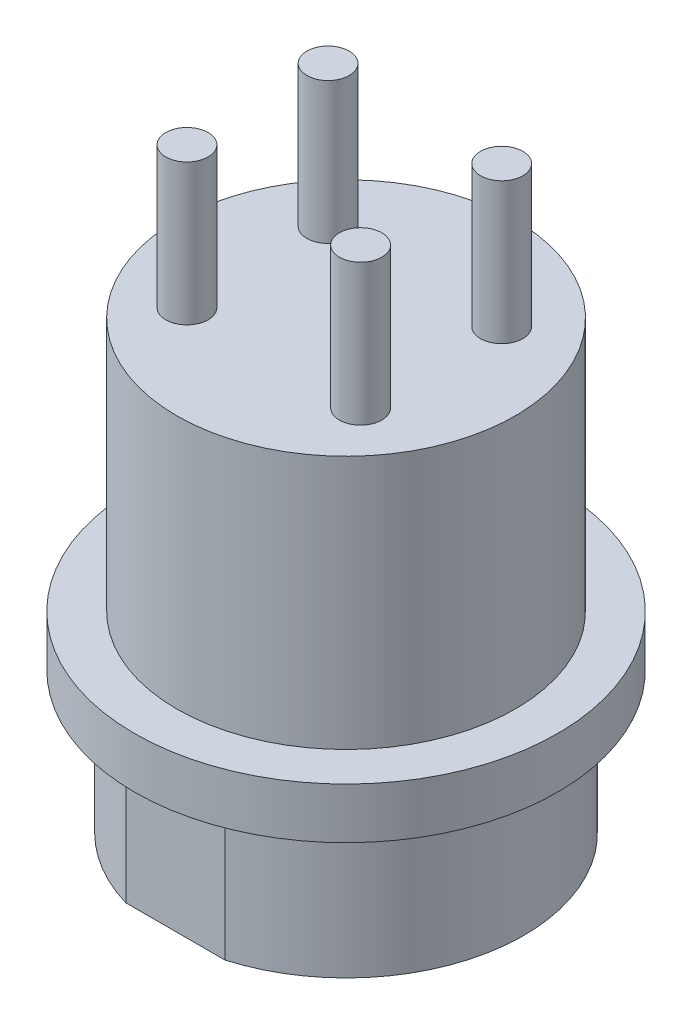
ISO-10303-21;
HEADER;
FILE_DESCRIPTION(('STEP AP214'),'2;1');
FILE_NAME('part.step','',(''),(''),'','','');
FILE_SCHEMA(('AUTOMOTIVE_DESIGN { 1 0 10303 214 1 1 1 1 }'));
ENDSEC;
DATA;
#1=APPLICATION_CONTEXT('core data for automotive mechanical design processes');
#2=APPLICATION_PROTOCOL_DEFINITION('international standard','automotive_design',2000,#1);
#3=PRODUCT_CONTEXT('',#1,'mechanical');
#4=PRODUCT('Part','Part','',(#3));
#5=PRODUCT_RELATED_PRODUCT_CATEGORY('part','',(#4));
#6=PRODUCT_DEFINITION_FORMATION('','',#4);
#7=PRODUCT_DEFINITION_CONTEXT('part definition',#1,'design');
#8=PRODUCT_DEFINITION('design','',#6,#7);
#9=PRODUCT_DEFINITION_SHAPE('','',#8);
#10=(LENGTH_UNIT() NAMED_UNIT(*) SI_UNIT(.MILLI.,.METRE.));
#11=(NAMED_UNIT(*) PLANE_ANGLE_UNIT() SI_UNIT($,.RADIAN.));
#12=(NAMED_UNIT(*) SI_UNIT($,.STERADIAN.) SOLID_ANGLE_UNIT());
#13=UNCERTAINTY_MEASURE_WITH_UNIT(LENGTH_MEASURE(1.E-05),#10,'distance_accuracy_value','');
#14=(GEOMETRIC_REPRESENTATION_CONTEXT(3) GLOBAL_UNCERTAINTY_ASSIGNED_CONTEXT((#13)) GLOBAL_UNIT_ASSIGNED_CONTEXT((#10,
#11,#12)) REPRESENTATION_CONTEXT('',''));
#15=CARTESIAN_POINT('',(0.,0.,0.));
#16=DIRECTION('',(0.,0.,1.));
#17=DIRECTION('',(1.,0.,0.));
#18=AXIS2_PLACEMENT_3D('',#15,#16,#17);
#19=CARTESIAN_POINT('',(0.,5.,0.));
#20=DIRECTION('',(0.,-1.,0.));
#21=DIRECTION('',(0.,0.,-1.));
#22=AXIS2_PLACEMENT_3D('',#19,#20,#21);
#23=CYLINDRICAL_SURFACE('',#22,6.3);
#24=CARTESIAN_POINT('',(0.,5.,0.));
#25=DIRECTION('',(0.,1.,0.));
#26=DIRECTION('',(0.,0.,1.));
#27=AXIS2_PLACEMENT_3D('',#24,#25,#26);
#28=CIRCLE('',#27,6.3);
#29=CARTESIAN_POINT('',(1.75712833908055,5.,6.05));
#30=VERTEX_POINT('',#29);
#31=CARTESIAN_POINT('',(2.55169780596398,5.,-5.76010749092746));
#32=VERTEX_POINT('',#31);
#33=EDGE_CURVE('E100',#30,#32,#28,.T.);
#34=ORIENTED_EDGE('',*,*,#33,.F.);
#35=DIRECTION('',(0.,-1.,0.));
#36=VECTOR('',#35,1.);
#37=CARTESIAN_POINT('',(1.75712833908055,5.,6.05));
#38=LINE('',#37,#36);
#39=CARTESIAN_POINT('',(1.75712833908055,0.,6.05));
#40=VERTEX_POINT('',#39);
#41=EDGE_CURVE('E235',#30,#40,#38,.T.);
#42=ORIENTED_EDGE('',*,*,#41,.T.);
#43=CARTESIAN_POINT('',(0.,0.,0.));
#44=DIRECTION('',(0.,1.,0.));
#45=DIRECTION('',(0.,0.,1.));
#46=AXIS2_PLACEMENT_3D('',#43,#44,#45);
#47=CIRCLE('',#46,6.3);
#48=CARTESIAN_POINT('',(2.55169780596398,0.,-5.76010749092746));
#49=VERTEX_POINT('',#48);
#50=EDGE_CURVE('E102',#40,#49,#47,.T.);
#51=ORIENTED_EDGE('',*,*,#50,.T.);
#52=DIRECTION('',(0.,-1.,0.));
#53=VECTOR('',#52,1.);
#54=CARTESIAN_POINT('',(2.55169780596398,5.,-5.76010749092746));
#55=LINE('',#54,#53);
#56=EDGE_CURVE('E57',#49,#32,#55,.F.);
#57=ORIENTED_EDGE('',*,*,#56,.T.);
#58=EDGE_LOOP('',(#34,#42,#51,#57));
#59=FACE_BOUND('',#58,.T.);
#60=ADVANCED_FACE('F34',(#59),#23,.T.);
#61=CARTESIAN_POINT('',(0.,10.,0.));
#62=DIRECTION('',(0.,-1.,0.));
#63=DIRECTION('',(0.,0.,-1.));
#64=AXIS2_PLACEMENT_3D('',#61,#62,#63);
#65=CYLINDRICAL_SURFACE('',#64,4.5);
#66=DIRECTION('',(0.,1.,0.));
#67=VECTOR('',#66,1.);
#68=CARTESIAN_POINT('',(-0.499227798766984,5.,4.47222222222222));
#69=LINE('',#68,#67);
#70=CARTESIAN_POINT('',(-0.499227798766984,0.,4.47222222222222));
#71=VERTEX_POINT('',#70);
#72=CARTESIAN_POINT('',(-0.499227798766983,10.,4.47222222222222));
#73=VERTEX_POINT('',#72);
#74=EDGE_CURVE('E193',#71,#73,#69,.T.);
#75=ORIENTED_EDGE('',*,*,#74,.F.);
#76=CARTESIAN_POINT('',(0.,0.,0.));
#77=DIRECTION('',(0.,-1.,0.));
#78=DIRECTION('',(0.,0.,-1.));
#79=AXIS2_PLACEMENT_3D('',#76,#77,#78);
#80=CIRCLE('',#79,4.5);
#81=CARTESIAN_POINT('',(0.499227798766984,0.,4.47222222222222));
#82=VERTEX_POINT('',#81);
#83=EDGE_CURVE('E190',#71,#82,#80,.T.);
#84=ORIENTED_EDGE('',*,*,#83,.T.);
#85=DIRECTION('',(0.,1.,0.));
#86=VECTOR('',#85,1.);
#87=CARTESIAN_POINT('',(0.499227798766984,5.,4.47222222222222));
#88=LINE('',#87,#86);
#89=CARTESIAN_POINT('',(0.499227798766984,10.,4.47222222222222));
#90=VERTEX_POINT('',#89);
#91=EDGE_CURVE('E197',#90,#82,#88,.F.);
#92=ORIENTED_EDGE('',*,*,#91,.F.);
#93=CARTESIAN_POINT('',(0.,10.,0.));
#94=DIRECTION('',(0.,-1.,0.));
#95=DIRECTION('',(0.,0.,-1.));
#96=AXIS2_PLACEMENT_3D('',#93,#94,#95);
#97=CIRCLE('',#96,4.5);
#98=EDGE_CURVE('E189',#73,#90,#97,.T.);
#99=ORIENTED_EDGE('',*,*,#98,.F.);
#100=EDGE_LOOP('',(#75,#84,#92,#99));
#101=FACE_BOUND('',#100,.T.);
#102=ADVANCED_FACE('F159',(#101),#65,.F.);
#103=CARTESIAN_POINT('',(-2.55169780596398,0.,-5.76010749092746));
#104=VERTEX_POINT('',#103);
#105=CARTESIAN_POINT('',(-1.75712833908055,0.,6.05));
#106=VERTEX_POINT('',#105);
#107=EDGE_CURVE('E119',#104,#106,#47,.T.);
#108=ORIENTED_EDGE('',*,*,#107,.T.);
#109=DIRECTION('',(0.,-1.,0.));
#110=VECTOR('',#109,1.);
#111=CARTESIAN_POINT('',(-1.75712833908055,5.,6.05));
#112=LINE('',#111,#110);
#113=CARTESIAN_POINT('',(-1.75712833908055,5.,6.05));
#114=VERTEX_POINT('',#113);
#115=EDGE_CURVE('E49',#106,#114,#112,.F.);
#116=ORIENTED_EDGE('',*,*,#115,.T.);
#117=CARTESIAN_POINT('',(-2.55169780596398,5.,-5.76010749092746));
#118=VERTEX_POINT('',#117);
#119=EDGE_CURVE('E109',#118,#114,#28,.T.);
#120=ORIENTED_EDGE('',*,*,#119,.F.);
#121=DIRECTION('',(0.,-1.,0.));
#122=VECTOR('',#121,1.);
#123=CARTESIAN_POINT('',(-2.55169780596398,5.,-5.76010749092746));
#124=LINE('',#123,#122);
#125=EDGE_CURVE('E88',#118,#104,#124,.T.);
#126=ORIENTED_EDGE('',*,*,#125,.T.);
#127=EDGE_LOOP('',(#108,#116,#120,#126));
#128=FACE_BOUND('',#127,.T.);
#129=ADVANCED_FACE('F161',(#128),#23,.T.);
#130=CARTESIAN_POINT('',(0.,0.,0.));
#131=DIRECTION('',(0.,1.,0.));
#132=DIRECTION('',(0.,0.,1.));
#133=AXIS2_PLACEMENT_3D('',#130,#131,#132);
#134=PLANE('',#133);
#135=ORIENTED_EDGE('',*,*,#83,.F.);
#136=CARTESIAN_POINT('',(0.,0.,4.5));
#137=DIRECTION('',(0.,1.,0.));
#138=DIRECTION('',(0.,0.,1.));
#139=AXIS2_PLACEMENT_3D('',#136,#137,#138);
#140=CIRCLE('',#139,0.5);
#141=EDGE_CURVE('E199',#82,#71,#140,.T.);
#142=ORIENTED_EDGE('',*,*,#141,.F.);
#143=EDGE_LOOP('',(#135,#142));
#144=FACE_BOUND('',#143,.T.);
#145=ORIENTED_EDGE('',*,*,#50,.F.);
#146=DIRECTION('',(1.,0.,0.));
#147=VECTOR('',#146,1.);
#148=CARTESIAN_POINT('',(-5.00000000000001,0.,6.05));
#149=LINE('',#148,#147);
#150=EDGE_CURVE('E93',#106,#40,#149,.T.);
#151=ORIENTED_EDGE('',*,*,#150,.F.);
#152=ORIENTED_EDGE('',*,*,#107,.F.);
#153=DIRECTION('',(-1.,0.,0.));
#154=VECTOR('',#153,1.);
#155=CARTESIAN_POINT('',(-5.,0.,-5.76010749092746));
#156=LINE('',#155,#154);
#157=EDGE_CURVE('E94',#49,#104,#156,.T.);
#158=ORIENTED_EDGE('',*,*,#157,.F.);
#159=EDGE_LOOP('',(#145,#151,#152,#158));
#160=FACE_BOUND('',#159,.T.);
#161=ADVANCED_FACE('F170',(#144,#160),#134,.F.);
#162=CARTESIAN_POINT('',(0.,6.8,0.));
#163=DIRECTION('',(0.,-1.,0.));
#164=DIRECTION('',(0.,0.,-1.));
#165=AXIS2_PLACEMENT_3D('',#162,#163,#164);
#166=CYLINDRICAL_SURFACE('',#165,7.5);
#167=CARTESIAN_POINT('',(0.,6.8,0.));
#168=DIRECTION('',(0.,1.,0.));
#169=DIRECTION('',(0.,0.,1.));
#170=AXIS2_PLACEMENT_3D('',#167,#168,#169);
#171=CIRCLE('',#170,7.5);
#172=CARTESIAN_POINT('',(0.,6.8,7.5));
#173=VERTEX_POINT('',#172);
#174=EDGE_CURVE('E180',#173,#173,#171,.T.);
#175=ORIENTED_EDGE('',*,*,#174,.F.);
#176=EDGE_LOOP('',(#175));
#177=FACE_BOUND('',#176,.T.);
#178=CARTESIAN_POINT('',(0.,5.,0.));
#179=DIRECTION('',(0.,1.,0.));
#180=DIRECTION('',(0.,0.,1.));
#181=AXIS2_PLACEMENT_3D('',#178,#179,#180);
#182=CIRCLE('',#181,7.5);
#183=CARTESIAN_POINT('',(0.,5.,7.5));
#184=VERTEX_POINT('',#183);
#185=EDGE_CURVE('E116',#184,#184,#182,.T.);
#186=ORIENTED_EDGE('',*,*,#185,.T.);
#187=EDGE_LOOP('',(#186));
#188=FACE_BOUND('',#187,.T.);
#189=ADVANCED_FACE('F175',(#177,#188),#166,.T.);
#190=CARTESIAN_POINT('',(0.,6.8,0.));
#191=DIRECTION('',(0.,1.,0.));
#192=DIRECTION('',(0.,0.,1.));
#193=AXIS2_PLACEMENT_3D('',#190,#191,#192);
#194=PLANE('',#193);
#195=CARTESIAN_POINT('',(0.,6.8,0.));
#196=DIRECTION('',(0.,1.,0.));
#197=DIRECTION('',(0.,0.,1.));
#198=AXIS2_PLACEMENT_3D('',#195,#196,#197);
#199=CIRCLE('',#198,6.);
#200=CARTESIAN_POINT('',(0.,6.8,6.));
#201=VERTEX_POINT('',#200);
#202=EDGE_CURVE('E108',#201,#201,#199,.T.);
#203=ORIENTED_EDGE('',*,*,#202,.F.);
#204=EDGE_LOOP('',(#203));
#205=FACE_BOUND('',#204,.T.);
#206=ORIENTED_EDGE('',*,*,#174,.T.);
#207=EDGE_LOOP('',(#206));
#208=FACE_BOUND('',#207,.T.);
#209=ADVANCED_FACE('F325',(#205,#208),#194,.T.);
#210=CARTESIAN_POINT('',(0.,5.,0.));
#211=DIRECTION('',(0.,1.,0.));
#212=DIRECTION('',(0.,0.,1.));
#213=AXIS2_PLACEMENT_3D('',#210,#211,#212);
#214=PLANE('',#213);
#215=ORIENTED_EDGE('',*,*,#119,.T.);
#216=DIRECTION('',(1.,0.,0.));
#217=VECTOR('',#216,1.);
#218=CARTESIAN_POINT('',(-5.00000000000001,5.,6.05));
#219=LINE('',#218,#217);
#220=EDGE_CURVE('E103',#114,#30,#219,.T.);
#221=ORIENTED_EDGE('',*,*,#220,.T.);
#222=ORIENTED_EDGE('',*,*,#33,.T.);
#223=DIRECTION('',(-1.,0.,0.));
#224=VECTOR('',#223,1.);
#225=CARTESIAN_POINT('',(-5.,5.,-5.76010749092746));
#226=LINE('',#225,#224);
#227=EDGE_CURVE('E85',#32,#118,#226,.T.);
#228=ORIENTED_EDGE('',*,*,#227,.T.);
#229=EDGE_LOOP('',(#215,#221,#222,#228));
#230=FACE_BOUND('',#229,.T.);
#231=ORIENTED_EDGE('',*,*,#185,.F.);
#232=EDGE_LOOP('',(#231));
#233=FACE_BOUND('',#232,.T.);
#234=ADVANCED_FACE('F106',(#230,#233),#214,.F.);
#235=CARTESIAN_POINT('',(0.,15.8,0.));
#236=DIRECTION('',(0.,-1.,0.));
#237=DIRECTION('',(0.,0.,-1.));
#238=AXIS2_PLACEMENT_3D('',#235,#236,#237);
#239=CYLINDRICAL_SURFACE('',#238,6.);
#240=CARTESIAN_POINT('',(0.,15.8,0.));
#241=DIRECTION('',(0.,1.,0.));
#242=DIRECTION('',(0.,0.,1.));
#243=AXIS2_PLACEMENT_3D('',#240,#241,#242);
#244=CIRCLE('',#243,6.);
#245=CARTESIAN_POINT('',(0.,15.8,6.));
#246=VERTEX_POINT('',#245);
#247=EDGE_CURVE('E185',#246,#246,#244,.T.);
#248=ORIENTED_EDGE('',*,*,#247,.F.);
#249=EDGE_LOOP('',(#248));
#250=FACE_BOUND('',#249,.T.);
#251=ORIENTED_EDGE('',*,*,#202,.T.);
#252=EDGE_LOOP('',(#251));
#253=FACE_BOUND('',#252,.T.);
#254=ADVANCED_FACE('F320',(#250,#253),#239,.T.);
#255=CARTESIAN_POINT('',(0.,15.8,0.));
#256=DIRECTION('',(0.,1.,0.));
#257=DIRECTION('',(0.,0.,1.));
#258=AXIS2_PLACEMENT_3D('',#255,#256,#257);
#259=PLANE('',#258);
#260=CARTESIAN_POINT('',(3.01543648249437,15.8,-2.5));
#261=DIRECTION('',(0.,1.,0.));
#262=DIRECTION('',(0.,0.,1.));
#263=AXIS2_PLACEMENT_3D('',#260,#261,#262);
#264=CIRCLE('',#263,0.75);
#265=CARTESIAN_POINT('',(3.01543648249437,15.8,-1.75));
#266=VERTEX_POINT('',#265);
#267=EDGE_CURVE('E232',#266,#266,#264,.T.);
#268=ORIENTED_EDGE('',*,*,#267,.F.);
#269=EDGE_LOOP('',(#268));
#270=FACE_BOUND('',#269,.T.);
#271=CARTESIAN_POINT('',(3.01543648249437,15.8,2.5));
#272=DIRECTION('',(0.,1.,0.));
#273=DIRECTION('',(0.,0.,1.));
#274=AXIS2_PLACEMENT_3D('',#271,#272,#273);
#275=CIRCLE('',#274,0.75);
#276=CARTESIAN_POINT('',(3.01543648249437,15.8,3.25));
#277=VERTEX_POINT('',#276);
#278=EDGE_CURVE('E226',#277,#277,#275,.T.);
#279=ORIENTED_EDGE('',*,*,#278,.F.);
#280=EDGE_LOOP('',(#279));
#281=FACE_BOUND('',#280,.T.);
#282=CARTESIAN_POINT('',(-3.13801520129497,15.8,2.5));
#283=DIRECTION('',(0.,1.,0.));
#284=DIRECTION('',(0.,0.,1.));
#285=AXIS2_PLACEMENT_3D('',#282,#283,#284);
#286=CIRCLE('',#285,0.75);
#287=CARTESIAN_POINT('',(-3.13801520129497,15.8,3.25));
#288=VERTEX_POINT('',#287);
#289=EDGE_CURVE('E220',#288,#288,#286,.T.);
#290=ORIENTED_EDGE('',*,*,#289,.F.);
#291=EDGE_LOOP('',(#290));
#292=FACE_BOUND('',#291,.T.);
#293=CARTESIAN_POINT('',(-3.13801520129497,15.8,-2.5));
#294=DIRECTION('',(0.,1.,0.));
#295=DIRECTION('',(0.,0.,1.));
#296=AXIS2_PLACEMENT_3D('',#293,#294,#295);
#297=CIRCLE('',#296,0.75);
#298=CARTESIAN_POINT('',(-3.13801520129497,15.8,-1.75));
#299=VERTEX_POINT('',#298);
#300=EDGE_CURVE('E214',#299,#299,#297,.T.);
#301=ORIENTED_EDGE('',*,*,#300,.F.);
#302=EDGE_LOOP('',(#301));
#303=FACE_BOUND('',#302,.T.);
#304=ORIENTED_EDGE('',*,*,#247,.T.);
#305=EDGE_LOOP('',(#304));
#306=FACE_BOUND('',#305,.T.);
#307=ADVANCED_FACE('F315',(#270,#281,#292,#303,#306),#259,.T.);
#308=CARTESIAN_POINT('',(0.,10.,0.));
#309=DIRECTION('',(0.,-1.,0.));
#310=DIRECTION('',(0.,0.,-1.));
#311=AXIS2_PLACEMENT_3D('',#308,#309,#310);
#312=PLANE('',#311);
#313=CARTESIAN_POINT('',(-2.,10.,-2.));
#314=DIRECTION('',(0.,-1.,0.));
#315=DIRECTION('',(0.,0.,-1.));
#316=AXIS2_PLACEMENT_3D('',#313,#314,#315);
#317=CIRCLE('',#316,0.5);
#318=CARTESIAN_POINT('',(-2.,10.,-2.5));
#319=VERTEX_POINT('',#318);
#320=EDGE_CURVE('E210',#319,#319,#317,.T.);
#321=ORIENTED_EDGE('',*,*,#320,.F.);
#322=EDGE_LOOP('',(#321));
#323=FACE_BOUND('',#322,.T.);
#324=CARTESIAN_POINT('',(2.,10.,-2.));
#325=DIRECTION('',(0.,-1.,0.));
#326=DIRECTION('',(0.,0.,-1.));
#327=AXIS2_PLACEMENT_3D('',#324,#325,#326);
#328=CIRCLE('',#327,0.5);
#329=CARTESIAN_POINT('',(2.,10.,-2.5));
#330=VERTEX_POINT('',#329);
#331=EDGE_CURVE('E207',#330,#330,#328,.T.);
#332=ORIENTED_EDGE('',*,*,#331,.F.);
#333=EDGE_LOOP('',(#332));
#334=FACE_BOUND('',#333,.T.);
#335=CARTESIAN_POINT('',(2.,10.,2.));
#336=DIRECTION('',(0.,-1.,0.));
#337=DIRECTION('',(0.,0.,-1.));
#338=AXIS2_PLACEMENT_3D('',#335,#336,#337);
#339=CIRCLE('',#338,0.5);
#340=CARTESIAN_POINT('',(2.,10.,1.5));
#341=VERTEX_POINT('',#340);
#342=EDGE_CURVE('E204',#341,#341,#339,.T.);
#343=ORIENTED_EDGE('',*,*,#342,.F.);
#344=EDGE_LOOP('',(#343));
#345=FACE_BOUND('',#344,.T.);
#346=CARTESIAN_POINT('',(-2.,10.,2.));
#347=DIRECTION('',(0.,-1.,0.));
#348=DIRECTION('',(0.,0.,-1.));
#349=AXIS2_PLACEMENT_3D('',#346,#347,#348);
#350=CIRCLE('',#349,0.5);
#351=CARTESIAN_POINT('',(-2.,10.,1.5));
#352=VERTEX_POINT('',#351);
#353=EDGE_CURVE('E201',#352,#352,#350,.T.);
#354=ORIENTED_EDGE('',*,*,#353,.F.);
#355=EDGE_LOOP('',(#354));
#356=FACE_BOUND('',#355,.T.);
#357=ORIENTED_EDGE('',*,*,#98,.T.);
#358=CARTESIAN_POINT('',(0.,10.,4.5));
#359=DIRECTION('',(0.,-1.,0.));
#360=DIRECTION('',(0.,0.,-1.));
#361=AXIS2_PLACEMENT_3D('',#358,#359,#360);
#362=CIRCLE('',#361,0.5);
#363=EDGE_CURVE('E112',#90,#73,#362,.F.);
#364=ORIENTED_EDGE('',*,*,#363,.T.);
#365=EDGE_LOOP('',(#357,#364));
#366=FACE_BOUND('',#365,.T.);
#367=ADVANCED_FACE('F312',(#323,#334,#345,#356,#366),#312,.T.);
#368=CARTESIAN_POINT('',(0.,-1.1180339887499,4.5));
#369=DIRECTION('',(0.,1.,0.));
#370=DIRECTION('',(0.,0.,1.));
#371=AXIS2_PLACEMENT_3D('',#368,#369,#370);
#372=CYLINDRICAL_SURFACE('',#371,0.5);
#373=ORIENTED_EDGE('',*,*,#141,.T.);
#374=ORIENTED_EDGE('',*,*,#74,.T.);
#375=ORIENTED_EDGE('',*,*,#363,.F.);
#376=ORIENTED_EDGE('',*,*,#91,.T.);
#377=EDGE_LOOP('',(#373,#374,#375,#376));
#378=FACE_BOUND('',#377,.T.);
#379=ADVANCED_FACE('F308',(#378),#372,.T.);
#380=CARTESIAN_POINT('',(-2.,2.,2.));
#381=DIRECTION('',(0.,1.,0.));
#382=DIRECTION('',(0.,0.,1.));
#383=AXIS2_PLACEMENT_3D('',#380,#381,#382);
#384=CYLINDRICAL_SURFACE('',#383,0.5);
#385=CARTESIAN_POINT('',(-2.,2.2,2.));
#386=DIRECTION('',(0.,-1.,0.));
#387=DIRECTION('',(0.,0.,-1.));
#388=AXIS2_PLACEMENT_3D('',#385,#386,#387);
#389=CIRCLE('',#388,0.5);
#390=CARTESIAN_POINT('',(-2.,2.2,1.5));
#391=VERTEX_POINT('',#390);
#392=EDGE_CURVE('E11',#391,#391,#389,.F.);
#393=ORIENTED_EDGE('',*,*,#392,.T.);
#394=EDGE_LOOP('',(#393));
#395=FACE_BOUND('',#394,.T.);
#396=ORIENTED_EDGE('',*,*,#353,.T.);
#397=EDGE_LOOP('',(#396));
#398=FACE_BOUND('',#397,.T.);
#399=ADVANCED_FACE('F305',(#395,#398),#384,.T.);
#400=CARTESIAN_POINT('',(-2.,2.,2.));
#401=DIRECTION('',(0.,-1.,0.));
#402=DIRECTION('',(0.,0.,-1.));
#403=AXIS2_PLACEMENT_3D('',#400,#401,#402);
#404=PLANE('',#403);
#405=CARTESIAN_POINT('',(-2.,2.,2.));
#406=DIRECTION('',(0.,-1.,0.));
#407=DIRECTION('',(0.,0.,-1.));
#408=AXIS2_PLACEMENT_3D('',#405,#406,#407);
#409=CIRCLE('',#408,0.3);
#410=CARTESIAN_POINT('',(-2.,2.,1.7));
#411=VERTEX_POINT('',#410);
#412=EDGE_CURVE('E42',#411,#411,#409,.T.);
#413=ORIENTED_EDGE('',*,*,#412,.T.);
#414=EDGE_LOOP('',(#413));
#415=FACE_BOUND('',#414,.T.);
#416=ADVANCED_FACE('F142',(#415),#404,.T.);
#417=CARTESIAN_POINT('',(2.,2.,2.));
#418=DIRECTION('',(0.,1.,0.));
#419=DIRECTION('',(0.,0.,1.));
#420=AXIS2_PLACEMENT_3D('',#417,#418,#419);
#421=CYLINDRICAL_SURFACE('',#420,0.5);
#422=CARTESIAN_POINT('',(2.,2.2,2.));
#423=DIRECTION('',(0.,-1.,0.));
#424=DIRECTION('',(0.,0.,-1.));
#425=AXIS2_PLACEMENT_3D('',#422,#423,#424);
#426=CIRCLE('',#425,0.5);
#427=CARTESIAN_POINT('',(2.,2.2,1.5));
#428=VERTEX_POINT('',#427);
#429=EDGE_CURVE('E137',#428,#428,#426,.F.);
#430=ORIENTED_EDGE('',*,*,#429,.T.);
#431=EDGE_LOOP('',(#430));
#432=FACE_BOUND('',#431,.T.);
#433=ORIENTED_EDGE('',*,*,#342,.T.);
#434=EDGE_LOOP('',(#433));
#435=FACE_BOUND('',#434,.T.);
#436=ADVANCED_FACE('F298',(#432,#435),#421,.T.);
#437=CARTESIAN_POINT('',(2.,2.,2.));
#438=DIRECTION('',(0.,-1.,0.));
#439=DIRECTION('',(0.,0.,-1.));
#440=AXIS2_PLACEMENT_3D('',#437,#438,#439);
#441=PLANE('',#440);
#442=CARTESIAN_POINT('',(2.,2.,2.));
#443=DIRECTION('',(0.,-1.,0.));
#444=DIRECTION('',(0.,0.,-1.));
#445=AXIS2_PLACEMENT_3D('',#442,#443,#444);
#446=CIRCLE('',#445,0.3);
#447=CARTESIAN_POINT('',(2.,2.,1.7));
#448=VERTEX_POINT('',#447);
#449=EDGE_CURVE('E134',#448,#448,#446,.T.);
#450=ORIENTED_EDGE('',*,*,#449,.T.);
#451=EDGE_LOOP('',(#450));
#452=FACE_BOUND('',#451,.T.);
#453=ADVANCED_FACE('F294',(#452),#441,.T.);
#454=CARTESIAN_POINT('',(2.,2.,-2.));
#455=DIRECTION('',(0.,1.,0.));
#456=DIRECTION('',(0.,0.,1.));
#457=AXIS2_PLACEMENT_3D('',#454,#455,#456);
#458=CYLINDRICAL_SURFACE('',#457,0.5);
#459=CARTESIAN_POINT('',(2.,2.2,-2.));
#460=DIRECTION('',(0.,-1.,0.));
#461=DIRECTION('',(0.,0.,-1.));
#462=AXIS2_PLACEMENT_3D('',#459,#460,#461);
#463=CIRCLE('',#462,0.5);
#464=CARTESIAN_POINT('',(2.,2.2,-2.5));
#465=VERTEX_POINT('',#464);
#466=EDGE_CURVE('E131',#465,#465,#463,.F.);
#467=ORIENTED_EDGE('',*,*,#466,.T.);
#468=EDGE_LOOP('',(#467));
#469=FACE_BOUND('',#468,.T.);
#470=ORIENTED_EDGE('',*,*,#331,.T.);
#471=EDGE_LOOP('',(#470));
#472=FACE_BOUND('',#471,.T.);
#473=ADVANCED_FACE('F290',(#469,#472),#458,.T.);
#474=CARTESIAN_POINT('',(2.,2.,-2.));
#475=DIRECTION('',(0.,-1.,0.));
#476=DIRECTION('',(0.,0.,-1.));
#477=AXIS2_PLACEMENT_3D('',#474,#475,#476);
#478=PLANE('',#477);
#479=CARTESIAN_POINT('',(2.,2.,-2.));
#480=DIRECTION('',(0.,-1.,0.));
#481=DIRECTION('',(0.,0.,-1.));
#482=AXIS2_PLACEMENT_3D('',#479,#480,#481);
#483=CIRCLE('',#482,0.3);
#484=CARTESIAN_POINT('',(2.,2.,-2.3));
#485=VERTEX_POINT('',#484);
#486=EDGE_CURVE('E128',#485,#485,#483,.T.);
#487=ORIENTED_EDGE('',*,*,#486,.T.);
#488=EDGE_LOOP('',(#487));
#489=FACE_BOUND('',#488,.T.);
#490=ADVANCED_FACE('F286',(#489),#478,.T.);
#491=CARTESIAN_POINT('',(-2.,2.,-2.));
#492=DIRECTION('',(0.,1.,0.));
#493=DIRECTION('',(0.,0.,1.));
#494=AXIS2_PLACEMENT_3D('',#491,#492,#493);
#495=CYLINDRICAL_SURFACE('',#494,0.5);
#496=CARTESIAN_POINT('',(-2.,2.2,-2.));
#497=DIRECTION('',(0.,-1.,0.));
#498=DIRECTION('',(0.,0.,-1.));
#499=AXIS2_PLACEMENT_3D('',#496,#497,#498);
#500=CIRCLE('',#499,0.5);
#501=CARTESIAN_POINT('',(-2.,2.2,-2.5));
#502=VERTEX_POINT('',#501);
#503=EDGE_CURVE('E125',#502,#502,#500,.F.);
#504=ORIENTED_EDGE('',*,*,#503,.T.);
#505=EDGE_LOOP('',(#504));
#506=FACE_BOUND('',#505,.T.);
#507=ORIENTED_EDGE('',*,*,#320,.T.);
#508=EDGE_LOOP('',(#507));
#509=FACE_BOUND('',#508,.T.);
#510=ADVANCED_FACE('F282',(#506,#509),#495,.T.);
#511=CARTESIAN_POINT('',(-2.,2.,-2.));
#512=DIRECTION('',(0.,-1.,0.));
#513=DIRECTION('',(0.,0.,-1.));
#514=AXIS2_PLACEMENT_3D('',#511,#512,#513);
#515=PLANE('',#514);
#516=CARTESIAN_POINT('',(-2.,2.,-2.));
#517=DIRECTION('',(0.,-1.,0.));
#518=DIRECTION('',(0.,0.,-1.));
#519=AXIS2_PLACEMENT_3D('',#516,#517,#518);
#520=CIRCLE('',#519,0.3);
#521=CARTESIAN_POINT('',(-2.,2.,-2.3));
#522=VERTEX_POINT('',#521);
#523=EDGE_CURVE('E122',#522,#522,#520,.T.);
#524=ORIENTED_EDGE('',*,*,#523,.T.);
#525=EDGE_LOOP('',(#524));
#526=FACE_BOUND('',#525,.T.);
#527=ADVANCED_FACE('F278',(#526),#515,.T.);
#528=CARTESIAN_POINT('',(-2.,2.2,-2.));
#529=DIRECTION('',(0.,-1.,0.));
#530=DIRECTION('',(0.,0.,-1.));
#531=AXIS2_PLACEMENT_3D('',#528,#529,#530);
#532=TOROIDAL_SURFACE('',#531,0.3,0.2);
#533=ORIENTED_EDGE('',*,*,#503,.F.);
#534=EDGE_LOOP('',(#533));
#535=FACE_BOUND('',#534,.T.);
#536=ORIENTED_EDGE('',*,*,#523,.F.);
#537=EDGE_LOOP('',(#536));
#538=FACE_BOUND('',#537,.T.);
#539=ADVANCED_FACE('F281',(#535,#538),#532,.T.);
#540=CARTESIAN_POINT('',(2.,2.2,-2.));
#541=DIRECTION('',(0.,-1.,0.));
#542=DIRECTION('',(0.,0.,-1.));
#543=AXIS2_PLACEMENT_3D('',#540,#541,#542);
#544=TOROIDAL_SURFACE('',#543,0.3,0.2);
#545=ORIENTED_EDGE('',*,*,#466,.F.);
#546=EDGE_LOOP('',(#545));
#547=FACE_BOUND('',#546,.T.);
#548=ORIENTED_EDGE('',*,*,#486,.F.);
#549=EDGE_LOOP('',(#548));
#550=FACE_BOUND('',#549,.T.);
#551=ADVANCED_FACE('F155',(#547,#550),#544,.T.);
#552=CARTESIAN_POINT('',(2.,2.2,2.));
#553=DIRECTION('',(0.,-1.,0.));
#554=DIRECTION('',(0.,0.,-1.));
#555=AXIS2_PLACEMENT_3D('',#552,#553,#554);
#556=TOROIDAL_SURFACE('',#555,0.3,0.2);
#557=ORIENTED_EDGE('',*,*,#429,.F.);
#558=EDGE_LOOP('',(#557));
#559=FACE_BOUND('',#558,.T.);
#560=ORIENTED_EDGE('',*,*,#449,.F.);
#561=EDGE_LOOP('',(#560));
#562=FACE_BOUND('',#561,.T.);
#563=ADVANCED_FACE('F146',(#559,#562),#556,.T.);
#564=CARTESIAN_POINT('',(-2.,2.2,2.));
#565=DIRECTION('',(0.,-1.,0.));
#566=DIRECTION('',(0.,0.,-1.));
#567=AXIS2_PLACEMENT_3D('',#564,#565,#566);
#568=TOROIDAL_SURFACE('',#567,0.3,0.2);
#569=ORIENTED_EDGE('',*,*,#392,.F.);
#570=EDGE_LOOP('',(#569));
#571=FACE_BOUND('',#570,.T.);
#572=ORIENTED_EDGE('',*,*,#412,.F.);
#573=EDGE_LOOP('',(#572));
#574=FACE_BOUND('',#573,.T.);
#575=ADVANCED_FACE('F36',(#571,#574),#568,.T.);
#576=CARTESIAN_POINT('',(-3.13801520129497,20.8,-2.5));
#577=DIRECTION('',(0.,-1.,0.));
#578=DIRECTION('',(0.,0.,-1.));
#579=AXIS2_PLACEMENT_3D('',#576,#577,#578);
#580=CYLINDRICAL_SURFACE('',#579,0.75);
#581=CARTESIAN_POINT('',(-3.13801520129497,20.8,-2.5));
#582=DIRECTION('',(0.,1.,0.));
#583=DIRECTION('',(0.,0.,1.));
#584=AXIS2_PLACEMENT_3D('',#581,#582,#583);
#585=CIRCLE('',#584,0.75);
#586=CARTESIAN_POINT('',(-3.13801520129497,20.8,-1.75));
#587=VERTEX_POINT('',#586);
#588=EDGE_CURVE('E213',#587,#587,#585,.T.);
#589=ORIENTED_EDGE('',*,*,#588,.F.);
#590=EDGE_LOOP('',(#589));
#591=FACE_BOUND('',#590,.T.);
#592=ORIENTED_EDGE('',*,*,#300,.T.);
#593=EDGE_LOOP('',(#592));
#594=FACE_BOUND('',#593,.T.);
#595=ADVANCED_FACE('F145',(#591,#594),#580,.T.);
#596=CARTESIAN_POINT('',(-3.13801520129497,20.8,-2.5));
#597=DIRECTION('',(0.,1.,0.));
#598=DIRECTION('',(0.,0.,1.));
#599=AXIS2_PLACEMENT_3D('',#596,#597,#598);
#600=PLANE('',#599);
#601=ORIENTED_EDGE('',*,*,#588,.T.);
#602=EDGE_LOOP('',(#601));
#603=FACE_BOUND('',#602,.T.);
#604=ADVANCED_FACE('F152',(#603),#600,.T.);
#605=CARTESIAN_POINT('',(-3.13801520129497,20.8,2.5));
#606=DIRECTION('',(0.,-1.,0.));
#607=DIRECTION('',(0.,0.,-1.));
#608=AXIS2_PLACEMENT_3D('',#605,#606,#607);
#609=CYLINDRICAL_SURFACE('',#608,0.75);
#610=CARTESIAN_POINT('',(-3.13801520129497,20.8,2.5));
#611=DIRECTION('',(0.,1.,0.));
#612=DIRECTION('',(0.,0.,1.));
#613=AXIS2_PLACEMENT_3D('',#610,#611,#612);
#614=CIRCLE('',#613,0.75);
#615=CARTESIAN_POINT('',(-3.13801520129497,20.8,3.25));
#616=VERTEX_POINT('',#615);
#617=EDGE_CURVE('E217',#616,#616,#614,.T.);
#618=ORIENTED_EDGE('',*,*,#617,.F.);
#619=EDGE_LOOP('',(#618));
#620=FACE_BOUND('',#619,.T.);
#621=ORIENTED_EDGE('',*,*,#289,.T.);
#622=EDGE_LOOP('',(#621));
#623=FACE_BOUND('',#622,.T.);
#624=ADVANCED_FACE('F270',(#620,#623),#609,.T.);
#625=CARTESIAN_POINT('',(-3.13801520129497,20.8,2.5));
#626=DIRECTION('',(0.,1.,0.));
#627=DIRECTION('',(0.,0.,1.));
#628=AXIS2_PLACEMENT_3D('',#625,#626,#627);
#629=PLANE('',#628);
#630=ORIENTED_EDGE('',*,*,#617,.T.);
#631=EDGE_LOOP('',(#630));
#632=FACE_BOUND('',#631,.T.);
#633=ADVANCED_FACE('F266',(#632),#629,.T.);
#634=CARTESIAN_POINT('',(3.01543648249437,20.8,2.5));
#635=DIRECTION('',(0.,-1.,0.));
#636=DIRECTION('',(0.,0.,-1.));
#637=AXIS2_PLACEMENT_3D('',#634,#635,#636);
#638=CYLINDRICAL_SURFACE('',#637,0.75);
#639=CARTESIAN_POINT('',(3.01543648249437,20.8,2.5));
#640=DIRECTION('',(0.,1.,0.));
#641=DIRECTION('',(0.,0.,1.));
#642=AXIS2_PLACEMENT_3D('',#639,#640,#641);
#643=CIRCLE('',#642,0.75);
#644=CARTESIAN_POINT('',(3.01543648249437,20.8,3.25));
#645=VERTEX_POINT('',#644);
#646=EDGE_CURVE('E223',#645,#645,#643,.T.);
#647=ORIENTED_EDGE('',*,*,#646,.F.);
#648=EDGE_LOOP('',(#647));
#649=FACE_BOUND('',#648,.T.);
#650=ORIENTED_EDGE('',*,*,#278,.T.);
#651=EDGE_LOOP('',(#650));
#652=FACE_BOUND('',#651,.T.);
#653=ADVANCED_FACE('F262',(#649,#652),#638,.T.);
#654=CARTESIAN_POINT('',(3.01543648249437,20.8,2.5));
#655=DIRECTION('',(0.,1.,0.));
#656=DIRECTION('',(0.,0.,1.));
#657=AXIS2_PLACEMENT_3D('',#654,#655,#656);
#658=PLANE('',#657);
#659=ORIENTED_EDGE('',*,*,#646,.T.);
#660=EDGE_LOOP('',(#659));
#661=FACE_BOUND('',#660,.T.);
#662=ADVANCED_FACE('F258',(#661),#658,.T.);
#663=CARTESIAN_POINT('',(3.01543648249437,20.8,-2.5));
#664=DIRECTION('',(0.,-1.,0.));
#665=DIRECTION('',(0.,0.,-1.));
#666=AXIS2_PLACEMENT_3D('',#663,#664,#665);
#667=CYLINDRICAL_SURFACE('',#666,0.75);
#668=CARTESIAN_POINT('',(3.01543648249437,20.8,-2.5));
#669=DIRECTION('',(0.,1.,0.));
#670=DIRECTION('',(0.,0.,1.));
#671=AXIS2_PLACEMENT_3D('',#668,#669,#670);
#672=CIRCLE('',#671,0.75);
#673=CARTESIAN_POINT('',(3.01543648249437,20.8,-1.75));
#674=VERTEX_POINT('',#673);
#675=EDGE_CURVE('E229',#674,#674,#672,.T.);
#676=ORIENTED_EDGE('',*,*,#675,.F.);
#677=EDGE_LOOP('',(#676));
#678=FACE_BOUND('',#677,.T.);
#679=ORIENTED_EDGE('',*,*,#267,.T.);
#680=EDGE_LOOP('',(#679));
#681=FACE_BOUND('',#680,.T.);
#682=ADVANCED_FACE('F254',(#678,#681),#667,.T.);
#683=CARTESIAN_POINT('',(3.01543648249437,20.8,-2.5));
#684=DIRECTION('',(0.,1.,0.));
#685=DIRECTION('',(0.,0.,1.));
#686=AXIS2_PLACEMENT_3D('',#683,#684,#685);
#687=PLANE('',#686);
#688=ORIENTED_EDGE('',*,*,#675,.T.);
#689=EDGE_LOOP('',(#688));
#690=FACE_BOUND('',#689,.T.);
#691=ADVANCED_FACE('F249',(#690),#687,.T.);
#692=CARTESIAN_POINT('',(-5.,15.0581278419699,-5.76010749092746));
#693=DIRECTION('',(0.,0.,1.));
#694=DIRECTION('',(1.,0.,0.));
#695=AXIS2_PLACEMENT_3D('',#692,#693,#694);
#696=PLANE('',#695);
#697=ORIENTED_EDGE('',*,*,#227,.F.);
#698=ORIENTED_EDGE('',*,*,#56,.F.);
#699=ORIENTED_EDGE('',*,*,#157,.T.);
#700=ORIENTED_EDGE('',*,*,#125,.F.);
#701=EDGE_LOOP('',(#697,#698,#699,#700));
#702=FACE_BOUND('',#701,.T.);
#703=ADVANCED_FACE('F86',(#702),#696,.F.);
#704=CARTESIAN_POINT('',(-5.00000000000001,15.0581278419699,6.05));
#705=DIRECTION('',(0.,0.,-1.));
#706=DIRECTION('',(-1.,0.,0.));
#707=AXIS2_PLACEMENT_3D('',#704,#705,#706);
#708=PLANE('',#707);
#709=ORIENTED_EDGE('',*,*,#220,.F.);
#710=ORIENTED_EDGE('',*,*,#115,.F.);
#711=ORIENTED_EDGE('',*,*,#150,.T.);
#712=ORIENTED_EDGE('',*,*,#41,.F.);
#713=EDGE_LOOP('',(#709,#710,#711,#712));
#714=FACE_BOUND('',#713,.T.);
#715=ADVANCED_FACE('F243',(#714),#708,.F.);
#716=CLOSED_SHELL('',(#60,#102,#129,#161,#189,#209,#234,#254,#307,#367,#379,#399,#416,#436,#453,
#473,#490,#510,#527,#539,#551,#563,#575,#595,#604,#624,#633,#653,#662,#682,#691,#703,#715));
#717=MANIFOLD_SOLID_BREP('B2',#716);
#718=ADVANCED_BREP_SHAPE_REPRESENTATION('',(#18,#717),#14);
#719=SHAPE_DEFINITION_REPRESENTATION(#9,#718);
ENDSEC;
END-ISO-10303-21;
